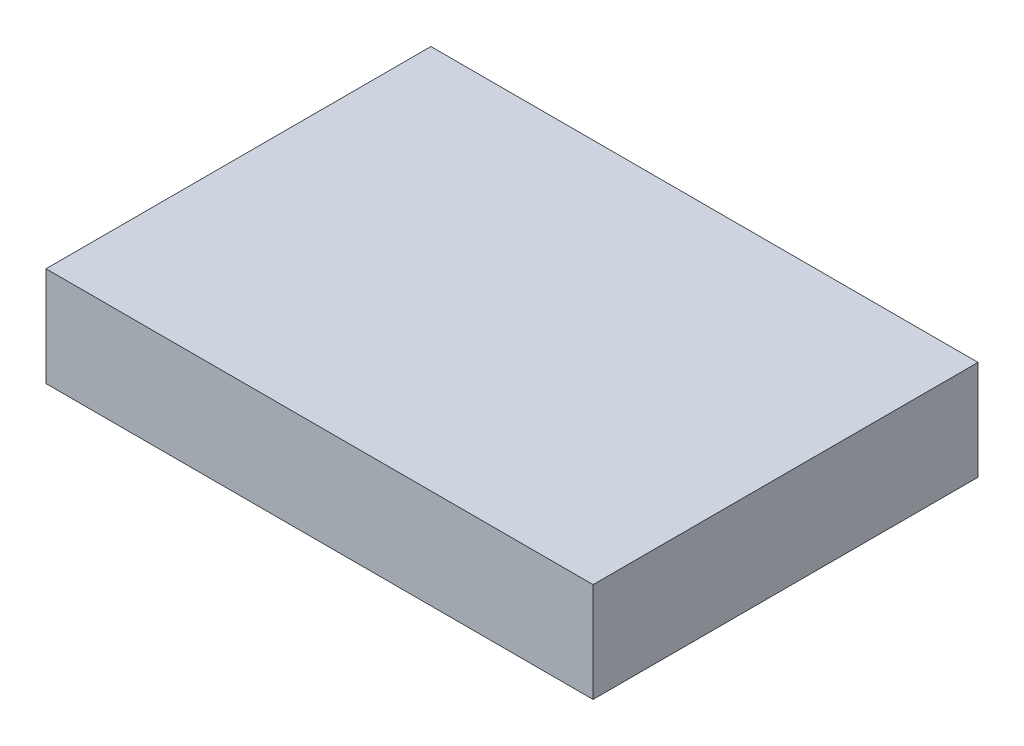
ISO-10303-21;
HEADER;
FILE_DESCRIPTION(('STEP AP214'),'2;1');
FILE_NAME('part.step','',(''),(''),'','','');
FILE_SCHEMA(('AUTOMOTIVE_DESIGN { 1 0 10303 214 1 1 1 1 }'));
ENDSEC;
DATA;
#1=APPLICATION_CONTEXT('core data for automotive mechanical design processes');
#2=APPLICATION_PROTOCOL_DEFINITION('international standard','automotive_design',2000,#1);
#3=PRODUCT_CONTEXT('',#1,'mechanical');
#4=PRODUCT('Part','Part','',(#3));
#5=PRODUCT_RELATED_PRODUCT_CATEGORY('part','',(#4));
#6=PRODUCT_DEFINITION_FORMATION('','',#4);
#7=PRODUCT_DEFINITION_CONTEXT('part definition',#1,'design');
#8=PRODUCT_DEFINITION('design','',#6,#7);
#9=PRODUCT_DEFINITION_SHAPE('','',#8);
#10=(LENGTH_UNIT() NAMED_UNIT(*) SI_UNIT(.MILLI.,.METRE.));
#11=(NAMED_UNIT(*) PLANE_ANGLE_UNIT() SI_UNIT($,.RADIAN.));
#12=(NAMED_UNIT(*) SI_UNIT($,.STERADIAN.) SOLID_ANGLE_UNIT());
#13=UNCERTAINTY_MEASURE_WITH_UNIT(LENGTH_MEASURE(1.E-05),#10,'distance_accuracy_value','');
#14=(GEOMETRIC_REPRESENTATION_CONTEXT(3) GLOBAL_UNCERTAINTY_ASSIGNED_CONTEXT((#13)) GLOBAL_UNIT_ASSIGNED_CONTEXT((#10,
#11,#12)) REPRESENTATION_CONTEXT('',''));
#15=CARTESIAN_POINT('',(0.,0.,0.));
#16=DIRECTION('',(0.,0.,1.));
#17=DIRECTION('',(1.,0.,0.));
#18=AXIS2_PLACEMENT_3D('',#15,#16,#17);
#19=CARTESIAN_POINT('',(12.65,2.3,8.89999999999999));
#20=DIRECTION('',(-1.,0.,0.));
#21=DIRECTION('',(0.,0.,1.));
#22=AXIS2_PLACEMENT_3D('',#19,#20,#21);
#23=PLANE('',#22);
#24=DIRECTION('',(0.,0.,-1.));
#25=VECTOR('',#24,1.);
#26=CARTESIAN_POINT('',(12.65,-2.3,8.89999999999999));
#27=LINE('',#26,#25);
#28=CARTESIAN_POINT('',(12.65,-2.3,8.89999999999999));
#29=VERTEX_POINT('',#28);
#30=CARTESIAN_POINT('',(12.65,-2.3,-8.89999999999999));
#31=VERTEX_POINT('',#30);
#32=EDGE_CURVE('E111',#29,#31,#27,.T.);
#33=ORIENTED_EDGE('',*,*,#32,.T.);
#34=DIRECTION('',(0.,-1.,0.));
#35=VECTOR('',#34,1.);
#36=CARTESIAN_POINT('',(12.65,2.3,-8.89999999999999));
#37=LINE('',#36,#35);
#38=CARTESIAN_POINT('',(12.65,2.3,-8.89999999999999));
#39=VERTEX_POINT('',#38);
#40=EDGE_CURVE('E11',#39,#31,#37,.T.);
#41=ORIENTED_EDGE('',*,*,#40,.F.);
#42=DIRECTION('',(0.,0.,-1.));
#43=VECTOR('',#42,1.);
#44=CARTESIAN_POINT('',(12.65,2.3,8.89999999999999));
#45=LINE('',#44,#43);
#46=CARTESIAN_POINT('',(12.65,2.3,8.89999999999999));
#47=VERTEX_POINT('',#46);
#48=EDGE_CURVE('E95',#47,#39,#45,.T.);
#49=ORIENTED_EDGE('',*,*,#48,.F.);
#50=DIRECTION('',(0.,-1.,0.));
#51=VECTOR('',#50,1.);
#52=CARTESIAN_POINT('',(12.65,2.3,8.89999999999999));
#53=LINE('',#52,#51);
#54=EDGE_CURVE('E107',#47,#29,#53,.T.);
#55=ORIENTED_EDGE('',*,*,#54,.T.);
#56=EDGE_LOOP('',(#33,#41,#49,#55));
#57=FACE_BOUND('',#56,.T.);
#58=ADVANCED_FACE('F43',(#57),#23,.F.);
#59=CARTESIAN_POINT('',(-12.65,2.3,-8.89999999999999));
#60=DIRECTION('',(0.,0.,1.));
#61=DIRECTION('',(1.,0.,0.));
#62=AXIS2_PLACEMENT_3D('',#59,#60,#61);
#63=PLANE('',#62);
#64=DIRECTION('',(-1.,0.,0.));
#65=VECTOR('',#64,1.);
#66=CARTESIAN_POINT('',(-12.65,-2.3,-8.89999999999999));
#67=LINE('',#66,#65);
#68=CARTESIAN_POINT('',(-12.65,-2.3,-8.89999999999999));
#69=VERTEX_POINT('',#68);
#70=EDGE_CURVE('E100',#31,#69,#67,.T.);
#71=ORIENTED_EDGE('',*,*,#70,.T.);
#72=DIRECTION('',(0.,-1.,0.));
#73=VECTOR('',#72,1.);
#74=CARTESIAN_POINT('',(-12.65,2.3,-8.89999999999999));
#75=LINE('',#74,#73);
#76=CARTESIAN_POINT('',(-12.65,2.3,-8.89999999999999));
#77=VERTEX_POINT('',#76);
#78=EDGE_CURVE('E52',#77,#69,#75,.T.);
#79=ORIENTED_EDGE('',*,*,#78,.F.);
#80=DIRECTION('',(-1.,0.,0.));
#81=VECTOR('',#80,1.);
#82=CARTESIAN_POINT('',(-12.65,2.3,-8.89999999999999));
#83=LINE('',#82,#81);
#84=EDGE_CURVE('E90',#39,#77,#83,.T.);
#85=ORIENTED_EDGE('',*,*,#84,.F.);
#86=ORIENTED_EDGE('',*,*,#40,.T.);
#87=EDGE_LOOP('',(#71,#79,#85,#86));
#88=FACE_BOUND('',#87,.T.);
#89=ADVANCED_FACE('F99',(#88),#63,.F.);
#90=CARTESIAN_POINT('',(-12.65,2.3,8.89999999999999));
#91=DIRECTION('',(1.,0.,0.));
#92=DIRECTION('',(0.,0.,-1.));
#93=AXIS2_PLACEMENT_3D('',#90,#91,#92);
#94=PLANE('',#93);
#95=DIRECTION('',(0.,0.,1.));
#96=VECTOR('',#95,1.);
#97=CARTESIAN_POINT('',(-12.65,-2.3,8.89999999999999));
#98=LINE('',#97,#96);
#99=CARTESIAN_POINT('',(-12.65,-2.3,8.89999999999999));
#100=VERTEX_POINT('',#99);
#101=EDGE_CURVE('E77',#69,#100,#98,.T.);
#102=ORIENTED_EDGE('',*,*,#101,.T.);
#103=DIRECTION('',(0.,-1.,0.));
#104=VECTOR('',#103,1.);
#105=CARTESIAN_POINT('',(-12.65,2.3,8.89999999999999));
#106=LINE('',#105,#104);
#107=CARTESIAN_POINT('',(-12.65,2.3,8.89999999999999));
#108=VERTEX_POINT('',#107);
#109=EDGE_CURVE('E102',#108,#100,#106,.T.);
#110=ORIENTED_EDGE('',*,*,#109,.F.);
#111=DIRECTION('',(0.,0.,1.));
#112=VECTOR('',#111,1.);
#113=CARTESIAN_POINT('',(-12.65,2.3,8.89999999999999));
#114=LINE('',#113,#112);
#115=EDGE_CURVE('E93',#77,#108,#114,.T.);
#116=ORIENTED_EDGE('',*,*,#115,.F.);
#117=ORIENTED_EDGE('',*,*,#78,.T.);
#118=EDGE_LOOP('',(#102,#110,#116,#117));
#119=FACE_BOUND('',#118,.T.);
#120=ADVANCED_FACE('F103',(#119),#94,.F.);
#121=CARTESIAN_POINT('',(-12.65,2.3,8.89999999999999));
#122=DIRECTION('',(0.,0.,-1.));
#123=DIRECTION('',(-1.,0.,0.));
#124=AXIS2_PLACEMENT_3D('',#121,#122,#123);
#125=PLANE('',#124);
#126=DIRECTION('',(1.,0.,0.));
#127=VECTOR('',#126,1.);
#128=CARTESIAN_POINT('',(-12.65,-2.3,8.89999999999999));
#129=LINE('',#128,#127);
#130=EDGE_CURVE('E83',#100,#29,#129,.T.);
#131=ORIENTED_EDGE('',*,*,#130,.T.);
#132=ORIENTED_EDGE('',*,*,#54,.F.);
#133=DIRECTION('',(1.,0.,0.));
#134=VECTOR('',#133,1.);
#135=CARTESIAN_POINT('',(-12.65,2.3,8.89999999999999));
#136=LINE('',#135,#134);
#137=EDGE_CURVE('E60',#108,#47,#136,.T.);
#138=ORIENTED_EDGE('',*,*,#137,.F.);
#139=ORIENTED_EDGE('',*,*,#109,.T.);
#140=EDGE_LOOP('',(#131,#132,#138,#139));
#141=FACE_BOUND('',#140,.T.);
#142=ADVANCED_FACE('F124',(#141),#125,.F.);
#143=CARTESIAN_POINT('',(0.,2.3,0.));
#144=DIRECTION('',(0.,-1.,0.));
#145=DIRECTION('',(0.,0.,-1.));
#146=AXIS2_PLACEMENT_3D('',#143,#144,#145);
#147=PLANE('',#146);
#148=ORIENTED_EDGE('',*,*,#48,.T.);
#149=ORIENTED_EDGE('',*,*,#84,.T.);
#150=ORIENTED_EDGE('',*,*,#115,.T.);
#151=ORIENTED_EDGE('',*,*,#137,.T.);
#152=EDGE_LOOP('',(#148,#149,#150,#151));
#153=FACE_BOUND('',#152,.T.);
#154=ADVANCED_FACE('F91',(#153),#147,.F.);
#155=CARTESIAN_POINT('',(0.,-2.3,0.));
#156=DIRECTION('',(0.,-1.,0.));
#157=DIRECTION('',(0.,0.,-1.));
#158=AXIS2_PLACEMENT_3D('',#155,#156,#157);
#159=PLANE('',#158);
#160=ORIENTED_EDGE('',*,*,#32,.F.);
#161=ORIENTED_EDGE('',*,*,#130,.F.);
#162=ORIENTED_EDGE('',*,*,#101,.F.);
#163=ORIENTED_EDGE('',*,*,#70,.F.);
#164=EDGE_LOOP('',(#160,#161,#162,#163));
#165=FACE_BOUND('',#164,.T.);
#166=ADVANCED_FACE('F127',(#165),#159,.T.);
#167=CLOSED_SHELL('',(#58,#89,#120,#142,#154,#166));
#168=MANIFOLD_SOLID_BREP('B2',#167);
#169=ADVANCED_BREP_SHAPE_REPRESENTATION('',(#18,#168),#14);
#170=SHAPE_DEFINITION_REPRESENTATION(#9,#169);
ENDSEC;
END-ISO-10303-21;
